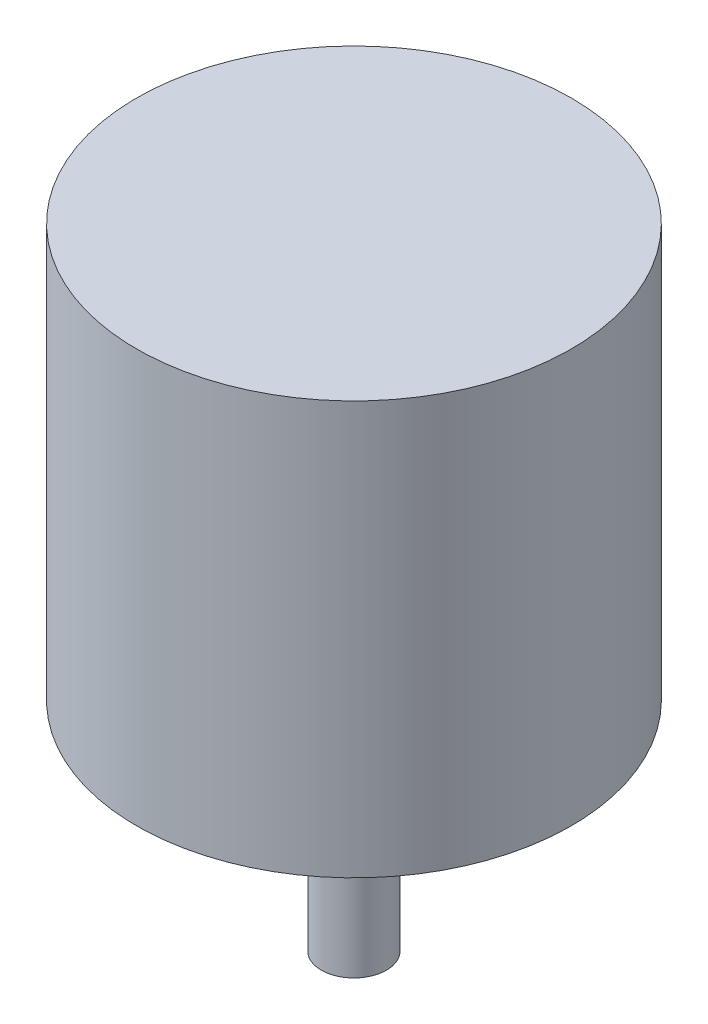
ISO-10303-21;
HEADER;
FILE_DESCRIPTION(('STEP AP214'),'2;1');
FILE_NAME('part.step','',(''),(''),'','','');
FILE_SCHEMA(('AUTOMOTIVE_DESIGN { 1 0 10303 214 1 1 1 1 }'));
ENDSEC;
DATA;
#1=APPLICATION_CONTEXT('core data for automotive mechanical design processes');
#2=APPLICATION_PROTOCOL_DEFINITION('international standard','automotive_design',2000,#1);
#3=PRODUCT_CONTEXT('',#1,'mechanical');
#4=PRODUCT('Part','Part','',(#3));
#5=PRODUCT_RELATED_PRODUCT_CATEGORY('part','',(#4));
#6=PRODUCT_DEFINITION_FORMATION('','',#4);
#7=PRODUCT_DEFINITION_CONTEXT('part definition',#1,'design');
#8=PRODUCT_DEFINITION('design','',#6,#7);
#9=PRODUCT_DEFINITION_SHAPE('','',#8);
#10=(LENGTH_UNIT() NAMED_UNIT(*) SI_UNIT(.MILLI.,.METRE.));
#11=(NAMED_UNIT(*) PLANE_ANGLE_UNIT() SI_UNIT($,.RADIAN.));
#12=(NAMED_UNIT(*) SI_UNIT($,.STERADIAN.) SOLID_ANGLE_UNIT());
#13=UNCERTAINTY_MEASURE_WITH_UNIT(LENGTH_MEASURE(1.E-05),#10,'distance_accuracy_value','');
#14=(GEOMETRIC_REPRESENTATION_CONTEXT(3) GLOBAL_UNCERTAINTY_ASSIGNED_CONTEXT((#13)) GLOBAL_UNIT_ASSIGNED_CONTEXT((#10,
#11,#12)) REPRESENTATION_CONTEXT('',''));
#15=CARTESIAN_POINT('',(0.,0.,0.));
#16=DIRECTION('',(0.,0.,1.));
#17=DIRECTION('',(1.,0.,0.));
#18=AXIS2_PLACEMENT_3D('',#15,#16,#17);
#19=CARTESIAN_POINT('',(0.,-38.,0.));
#20=DIRECTION('',(0.,1.,0.));
#21=DIRECTION('',(0.,0.,1.));
#22=AXIS2_PLACEMENT_3D('',#19,#20,#21);
#23=CYLINDRICAL_SURFACE('',#22,20.);
#24=CARTESIAN_POINT('',(0.,-38.,0.));
#25=DIRECTION('',(0.,-1.,0.));
#26=DIRECTION('',(0.,0.,-1.));
#27=AXIS2_PLACEMENT_3D('',#24,#25,#26);
#28=CIRCLE('',#27,20.);
#29=CARTESIAN_POINT('',(0.,-38.,-20.));
#30=VERTEX_POINT('',#29);
#31=EDGE_CURVE('E43',#30,#30,#28,.T.);
#32=ORIENTED_EDGE('',*,*,#31,.F.);
#33=EDGE_LOOP('',(#32));
#34=FACE_BOUND('',#33,.T.);
#35=CARTESIAN_POINT('',(0.,0.,0.));
#36=DIRECTION('',(0.,-1.,0.));
#37=DIRECTION('',(0.,0.,-1.));
#38=AXIS2_PLACEMENT_3D('',#35,#36,#37);
#39=CIRCLE('',#38,20.);
#40=CARTESIAN_POINT('',(0.,0.,-20.));
#41=VERTEX_POINT('',#40);
#42=EDGE_CURVE('E34',#41,#41,#39,.T.);
#43=ORIENTED_EDGE('',*,*,#42,.T.);
#44=EDGE_LOOP('',(#43));
#45=FACE_BOUND('',#44,.T.);
#46=ADVANCED_FACE('F31',(#34,#45),#23,.T.);
#47=CARTESIAN_POINT('',(0.,-38.,0.));
#48=DIRECTION('',(0.,-1.,0.));
#49=DIRECTION('',(0.,0.,-1.));
#50=AXIS2_PLACEMENT_3D('',#47,#48,#49);
#51=PLANE('',#50);
#52=CARTESIAN_POINT('',(0.,-38.,0.));
#53=DIRECTION('',(0.,-1.,0.));
#54=DIRECTION('',(0.,0.,-1.));
#55=AXIS2_PLACEMENT_3D('',#52,#53,#54);
#56=CIRCLE('',#55,10.);
#57=CARTESIAN_POINT('',(0.,-38.,-10.));
#58=VERTEX_POINT('',#57);
#59=EDGE_CURVE('E38',#58,#58,#56,.T.);
#60=ORIENTED_EDGE('',*,*,#59,.F.);
#61=EDGE_LOOP('',(#60));
#62=FACE_BOUND('',#61,.T.);
#63=ORIENTED_EDGE('',*,*,#31,.T.);
#64=EDGE_LOOP('',(#63));
#65=FACE_BOUND('',#64,.T.);
#66=ADVANCED_FACE('F60',(#62,#65),#51,.T.);
#67=CARTESIAN_POINT('',(0.,0.,0.));
#68=DIRECTION('',(0.,-1.,0.));
#69=DIRECTION('',(0.,0.,-1.));
#70=AXIS2_PLACEMENT_3D('',#67,#68,#69);
#71=PLANE('',#70);
#72=ORIENTED_EDGE('',*,*,#42,.F.);
#73=EDGE_LOOP('',(#72));
#74=FACE_BOUND('',#73,.T.);
#75=ADVANCED_FACE('F57',(#74),#71,.F.);
#76=CARTESIAN_POINT('',(0.,-43.,0.));
#77=DIRECTION('',(0.,1.,0.));
#78=DIRECTION('',(0.,0.,1.));
#79=AXIS2_PLACEMENT_3D('',#76,#77,#78);
#80=CYLINDRICAL_SURFACE('',#79,10.);
#81=CARTESIAN_POINT('',(0.,-43.,0.));
#82=DIRECTION('',(0.,-1.,0.));
#83=DIRECTION('',(0.,0.,-1.));
#84=AXIS2_PLACEMENT_3D('',#81,#82,#83);
#85=CIRCLE('',#84,10.);
#86=CARTESIAN_POINT('',(0.,-43.,-10.));
#87=VERTEX_POINT('',#86);
#88=EDGE_CURVE('E48',#87,#87,#85,.T.);
#89=ORIENTED_EDGE('',*,*,#88,.F.);
#90=EDGE_LOOP('',(#89));
#91=FACE_BOUND('',#90,.T.);
#92=ORIENTED_EDGE('',*,*,#59,.T.);
#93=EDGE_LOOP('',(#92));
#94=FACE_BOUND('',#93,.T.);
#95=ADVANCED_FACE('F59',(#91,#94),#80,.T.);
#96=CARTESIAN_POINT('',(0.,-43.,0.));
#97=DIRECTION('',(0.,-1.,0.));
#98=DIRECTION('',(0.,0.,-1.));
#99=AXIS2_PLACEMENT_3D('',#96,#97,#98);
#100=PLANE('',#99);
#101=CARTESIAN_POINT('',(0.,-43.,0.));
#102=DIRECTION('',(0.,-1.,0.));
#103=DIRECTION('',(0.,0.,-1.));
#104=AXIS2_PLACEMENT_3D('',#101,#102,#103);
#105=CIRCLE('',#104,3.);
#106=CARTESIAN_POINT('',(0.,-43.,-3.));
#107=VERTEX_POINT('',#106);
#108=EDGE_CURVE('E10',#107,#107,#105,.T.);
#109=ORIENTED_EDGE('',*,*,#108,.F.);
#110=EDGE_LOOP('',(#109));
#111=FACE_BOUND('',#110,.T.);
#112=ORIENTED_EDGE('',*,*,#88,.T.);
#113=EDGE_LOOP('',(#112));
#114=FACE_BOUND('',#113,.T.);
#115=ADVANCED_FACE('F65',(#111,#114),#100,.T.);
#116=CARTESIAN_POINT('',(0.,-58.,0.));
#117=DIRECTION('',(0.,1.,0.));
#118=DIRECTION('',(0.,0.,1.));
#119=AXIS2_PLACEMENT_3D('',#116,#117,#118);
#120=CYLINDRICAL_SURFACE('',#119,3.);
#121=CARTESIAN_POINT('',(0.,-58.,0.));
#122=DIRECTION('',(0.,-1.,0.));
#123=DIRECTION('',(0.,0.,-1.));
#124=AXIS2_PLACEMENT_3D('',#121,#122,#123);
#125=CIRCLE('',#124,3.);
#126=CARTESIAN_POINT('',(0.,-58.,-3.));
#127=VERTEX_POINT('',#126);
#128=EDGE_CURVE('E47',#127,#127,#125,.T.);
#129=ORIENTED_EDGE('',*,*,#128,.F.);
#130=EDGE_LOOP('',(#129));
#131=FACE_BOUND('',#130,.T.);
#132=ORIENTED_EDGE('',*,*,#108,.T.);
#133=EDGE_LOOP('',(#132));
#134=FACE_BOUND('',#133,.T.);
#135=ADVANCED_FACE('F95',(#131,#134),#120,.T.);
#136=CARTESIAN_POINT('',(0.,-58.,0.));
#137=DIRECTION('',(0.,-1.,0.));
#138=DIRECTION('',(0.,0.,-1.));
#139=AXIS2_PLACEMENT_3D('',#136,#137,#138);
#140=PLANE('',#139);
#141=ORIENTED_EDGE('',*,*,#128,.T.);
#142=EDGE_LOOP('',(#141));
#143=FACE_BOUND('',#142,.T.);
#144=ADVANCED_FACE('F105',(#143),#140,.T.);
#145=CLOSED_SHELL('',(#46,#66,#75,#95,#115,#135,#144));
#146=MANIFOLD_SOLID_BREP('B2',#145);
#147=ADVANCED_BREP_SHAPE_REPRESENTATION('',(#18,#146),#14);
#148=SHAPE_DEFINITION_REPRESENTATION(#9,#147);
ENDSEC;
END-ISO-10303-21;
